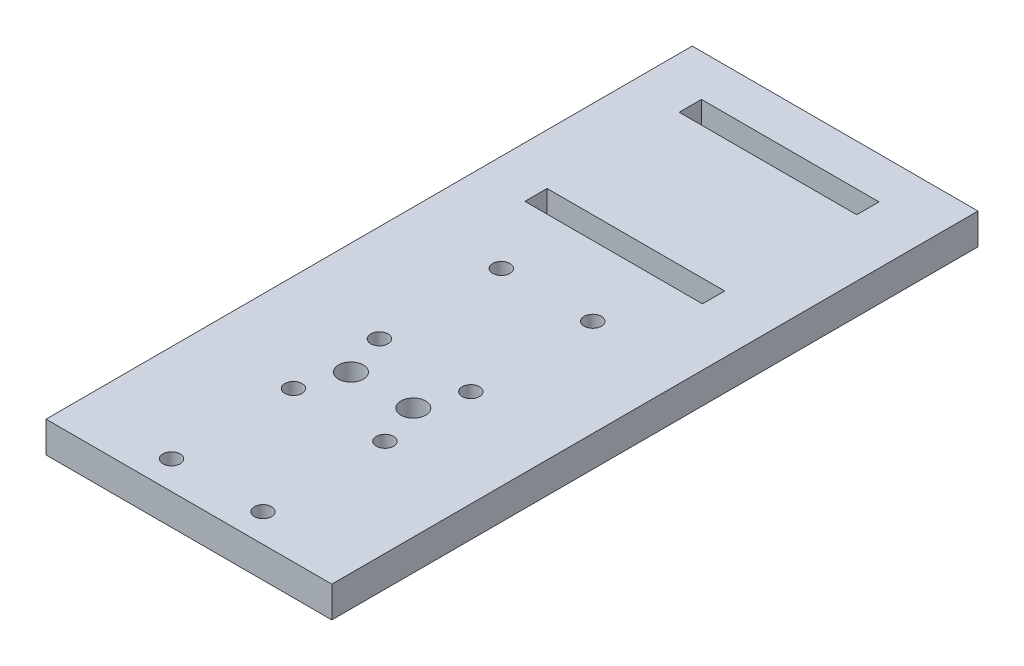
ISO-10303-21;
HEADER;
FILE_DESCRIPTION(('STEP AP214'),'2;1');
FILE_NAME('part.step','',(''),(''),'','','');
FILE_SCHEMA(('AUTOMOTIVE_DESIGN { 1 0 10303 214 1 1 1 1 }'));
ENDSEC;
DATA;
#1=APPLICATION_CONTEXT('core data for automotive mechanical design processes');
#2=APPLICATION_PROTOCOL_DEFINITION('international standard','automotive_design',2000,#1);
#3=PRODUCT_CONTEXT('',#1,'mechanical');
#4=PRODUCT('Part','Part','',(#3));
#5=PRODUCT_RELATED_PRODUCT_CATEGORY('part','',(#4));
#6=PRODUCT_DEFINITION_FORMATION('','',#4);
#7=PRODUCT_DEFINITION_CONTEXT('part definition',#1,'design');
#8=PRODUCT_DEFINITION('design','',#6,#7);
#9=PRODUCT_DEFINITION_SHAPE('','',#8);
#10=(LENGTH_UNIT() NAMED_UNIT(*) SI_UNIT(.MILLI.,.METRE.));
#11=(NAMED_UNIT(*) PLANE_ANGLE_UNIT() SI_UNIT($,.RADIAN.));
#12=(NAMED_UNIT(*) SI_UNIT($,.STERADIAN.) SOLID_ANGLE_UNIT());
#13=UNCERTAINTY_MEASURE_WITH_UNIT(LENGTH_MEASURE(1.E-05),#10,'distance_accuracy_value','');
#14=(GEOMETRIC_REPRESENTATION_CONTEXT(3) GLOBAL_UNCERTAINTY_ASSIGNED_CONTEXT((#13)) GLOBAL_UNIT_ASSIGNED_CONTEXT((#10,
#11,#12)) REPRESENTATION_CONTEXT('',''));
#15=CARTESIAN_POINT('',(0.,0.,0.));
#16=DIRECTION('',(0.,0.,1.));
#17=DIRECTION('',(1.,0.,0.));
#18=AXIS2_PLACEMENT_3D('',#15,#16,#17);
#19=CARTESIAN_POINT('',(0.,5.969,0.));
#20=DIRECTION('',(0.,-1.,0.));
#21=DIRECTION('',(0.,0.,-1.));
#22=AXIS2_PLACEMENT_3D('',#19,#20,#21);
#23=PLANE('',#22);
#24=DIRECTION('',(0.,0.,1.));
#25=VECTOR('',#24,1.);
#26=CARTESIAN_POINT('',(0.,5.969,0.));
#27=LINE('',#26,#25);
#28=CARTESIAN_POINT('',(0.,5.969,-124.36));
#29=VERTEX_POINT('',#28);
#30=CARTESIAN_POINT('',(0.,5.969,0.));
#31=VERTEX_POINT('',#30);
#32=EDGE_CURVE('E269',#29,#31,#27,.T.);
#33=ORIENTED_EDGE('',*,*,#32,.T.);
#34=DIRECTION('',(1.,0.,0.));
#35=VECTOR('',#34,1.);
#36=CARTESIAN_POINT('',(0.,5.969,0.));
#37=LINE('',#36,#35);
#38=CARTESIAN_POINT('',(55.,5.969,0.));
#39=VERTEX_POINT('',#38);
#40=EDGE_CURVE('E49',#31,#39,#37,.T.);
#41=ORIENTED_EDGE('',*,*,#40,.T.);
#42=DIRECTION('',(0.,0.,-1.));
#43=VECTOR('',#42,1.);
#44=CARTESIAN_POINT('',(55.,5.969,0.));
#45=LINE('',#44,#43);
#46=CARTESIAN_POINT('',(55.,5.969,-124.36));
#47=VERTEX_POINT('',#46);
#48=EDGE_CURVE('E273',#39,#47,#45,.T.);
#49=ORIENTED_EDGE('',*,*,#48,.T.);
#50=DIRECTION('',(-1.,0.,0.));
#51=VECTOR('',#50,1.);
#52=CARTESIAN_POINT('',(55.,5.969,-124.36));
#53=LINE('',#52,#51);
#54=EDGE_CURVE('E190',#47,#29,#53,.T.);
#55=ORIENTED_EDGE('',*,*,#54,.T.);
#56=EDGE_LOOP('',(#33,#41,#49,#55));
#57=FACE_BOUND('',#56,.T.);
#58=CARTESIAN_POINT('',(18.7,5.969,-68.92));
#59=DIRECTION('',(0.,1.,0.));
#60=DIRECTION('',(0.,0.,1.));
#61=AXIS2_PLACEMENT_3D('',#58,#59,#60);
#62=CIRCLE('',#61,1.66);
#63=CARTESIAN_POINT('',(18.7,5.969,-67.26));
#64=VERTEX_POINT('',#63);
#65=EDGE_CURVE('E263',#64,#64,#62,.T.);
#66=ORIENTED_EDGE('',*,*,#65,.F.);
#67=EDGE_LOOP('',(#66));
#68=FACE_BOUND('',#67,.T.);
#69=CARTESIAN_POINT('',(36.3,5.969,-68.92));
#70=DIRECTION('',(0.,1.,0.));
#71=DIRECTION('',(0.,0.,1.));
#72=AXIS2_PLACEMENT_3D('',#69,#70,#71);
#73=CIRCLE('',#72,1.66);
#74=CARTESIAN_POINT('',(36.3,5.969,-67.26));
#75=VERTEX_POINT('',#74);
#76=EDGE_CURVE('E257',#75,#75,#73,.T.);
#77=ORIENTED_EDGE('',*,*,#76,.F.);
#78=EDGE_LOOP('',(#77));
#79=FACE_BOUND('',#78,.T.);
#80=CARTESIAN_POINT('',(36.3,5.969,-45.46));
#81=DIRECTION('',(0.,1.,0.));
#82=DIRECTION('',(0.,0.,1.));
#83=AXIS2_PLACEMENT_3D('',#80,#81,#82);
#84=CIRCLE('',#83,1.66);
#85=CARTESIAN_POINT('',(36.3,5.969,-43.8));
#86=VERTEX_POINT('',#85);
#87=EDGE_CURVE('E251',#86,#86,#84,.T.);
#88=ORIENTED_EDGE('',*,*,#87,.F.);
#89=EDGE_LOOP('',(#88));
#90=FACE_BOUND('',#89,.T.);
#91=CARTESIAN_POINT('',(18.7,5.969,-45.46));
#92=DIRECTION('',(0.,1.,0.));
#93=DIRECTION('',(0.,0.,1.));
#94=AXIS2_PLACEMENT_3D('',#91,#92,#93);
#95=CIRCLE('',#94,1.66);
#96=CARTESIAN_POINT('',(18.7,5.969,-43.8));
#97=VERTEX_POINT('',#96);
#98=EDGE_CURVE('E245',#97,#97,#95,.T.);
#99=ORIENTED_EDGE('',*,*,#98,.F.);
#100=EDGE_LOOP('',(#99));
#101=FACE_BOUND('',#100,.T.);
#102=CARTESIAN_POINT('',(18.7,5.969,-28.92));
#103=DIRECTION('',(0.,1.,0.));
#104=DIRECTION('',(0.,0.,-1.));
#105=AXIS2_PLACEMENT_3D('',#102,#103,#104);
#106=CIRCLE('',#105,1.66);
#107=CARTESIAN_POINT('',(18.7,5.969,-30.58));
#108=VERTEX_POINT('',#107);
#109=EDGE_CURVE('E239',#108,#108,#106,.T.);
#110=ORIENTED_EDGE('',*,*,#109,.F.);
#111=EDGE_LOOP('',(#110));
#112=FACE_BOUND('',#111,.T.);
#113=CARTESIAN_POINT('',(36.3,5.969,-28.92));
#114=DIRECTION('',(0.,1.,0.));
#115=DIRECTION('',(0.,0.,-1.));
#116=AXIS2_PLACEMENT_3D('',#113,#114,#115);
#117=CIRCLE('',#116,1.66);
#118=CARTESIAN_POINT('',(36.3,5.969,-30.58));
#119=VERTEX_POINT('',#118);
#120=EDGE_CURVE('E233',#119,#119,#117,.T.);
#121=ORIENTED_EDGE('',*,*,#120,.F.);
#122=EDGE_LOOP('',(#121));
#123=FACE_BOUND('',#122,.T.);
#124=CARTESIAN_POINT('',(36.3,5.969,-5.45999999999999));
#125=DIRECTION('',(0.,1.,0.));
#126=DIRECTION('',(0.,0.,-1.));
#127=AXIS2_PLACEMENT_3D('',#124,#125,#126);
#128=CIRCLE('',#127,1.66);
#129=CARTESIAN_POINT('',(36.3,5.969,-7.11999999999999));
#130=VERTEX_POINT('',#129);
#131=EDGE_CURVE('E227',#130,#130,#128,.T.);
#132=ORIENTED_EDGE('',*,*,#131,.F.);
#133=EDGE_LOOP('',(#132));
#134=FACE_BOUND('',#133,.T.);
#135=CARTESIAN_POINT('',(18.7,5.969,-5.45999999999999));
#136=DIRECTION('',(0.,1.,0.));
#137=DIRECTION('',(0.,0.,-1.));
#138=AXIS2_PLACEMENT_3D('',#135,#136,#137);
#139=CIRCLE('',#138,1.66);
#140=CARTESIAN_POINT('',(18.7,5.969,-7.12));
#141=VERTEX_POINT('',#140);
#142=EDGE_CURVE('E221',#141,#141,#139,.T.);
#143=ORIENTED_EDGE('',*,*,#142,.F.);
#144=EDGE_LOOP('',(#143));
#145=FACE_BOUND('',#144,.T.);
#146=CARTESIAN_POINT('',(33.5,5.969,-37.19));
#147=DIRECTION('',(0.,1.,0.));
#148=DIRECTION('',(0.,0.,-1.));
#149=AXIS2_PLACEMENT_3D('',#146,#147,#148);
#150=CIRCLE('',#149,2.38125);
#151=CARTESIAN_POINT('',(33.5,5.969,-39.57125));
#152=VERTEX_POINT('',#151);
#153=EDGE_CURVE('E215',#152,#152,#150,.T.);
#154=ORIENTED_EDGE('',*,*,#153,.F.);
#155=EDGE_LOOP('',(#154));
#156=FACE_BOUND('',#155,.T.);
#157=CARTESIAN_POINT('',(21.5,5.969,-37.19));
#158=DIRECTION('',(0.,1.,0.));
#159=DIRECTION('',(0.,0.,1.));
#160=AXIS2_PLACEMENT_3D('',#157,#158,#159);
#161=CIRCLE('',#160,2.38125);
#162=CARTESIAN_POINT('',(21.5,5.969,-34.80875));
#163=VERTEX_POINT('',#162);
#164=EDGE_CURVE('E209',#163,#163,#161,.T.);
#165=ORIENTED_EDGE('',*,*,#164,.F.);
#166=EDGE_LOOP('',(#165));
#167=FACE_BOUND('',#166,.T.);
#168=DIRECTION('',(0.,0.,-1.));
#169=VECTOR('',#168,1.);
#170=CARTESIAN_POINT('',(43.95,5.969,-116.36));
#171=LINE('',#170,#169);
#172=CARTESIAN_POINT('',(43.95,5.969,-112.08));
#173=VERTEX_POINT('',#172);
#174=CARTESIAN_POINT('',(43.95,5.969,-116.36));
#175=VERTEX_POINT('',#174);
#176=EDGE_CURVE('E131',#173,#175,#171,.T.);
#177=ORIENTED_EDGE('',*,*,#176,.F.);
#178=DIRECTION('',(1.,0.,0.));
#179=VECTOR('',#178,1.);
#180=CARTESIAN_POINT('',(43.95,5.969,-112.08));
#181=LINE('',#180,#179);
#182=CARTESIAN_POINT('',(9.77999999999999,5.969,-112.08));
#183=VERTEX_POINT('',#182);
#184=EDGE_CURVE('E146',#183,#173,#181,.T.);
#185=ORIENTED_EDGE('',*,*,#184,.F.);
#186=DIRECTION('',(0.,0.,1.));
#187=VECTOR('',#186,1.);
#188=CARTESIAN_POINT('',(9.77999999999999,5.969,-116.36));
#189=LINE('',#188,#187);
#190=CARTESIAN_POINT('',(9.77999999999999,5.969,-116.36));
#191=VERTEX_POINT('',#190);
#192=EDGE_CURVE('E149',#191,#183,#189,.T.);
#193=ORIENTED_EDGE('',*,*,#192,.F.);
#194=DIRECTION('',(-1.,0.,0.));
#195=VECTOR('',#194,1.);
#196=CARTESIAN_POINT('',(43.95,5.969,-116.36));
#197=LINE('',#196,#195);
#198=EDGE_CURVE('E155',#175,#191,#197,.T.);
#199=ORIENTED_EDGE('',*,*,#198,.F.);
#200=EDGE_LOOP('',(#177,#185,#193,#199));
#201=FACE_BOUND('',#200,.T.);
#202=DIRECTION('',(0.,0.,-1.));
#203=VECTOR('',#202,1.);
#204=CARTESIAN_POINT('',(43.95,5.969,-82.38));
#205=LINE('',#204,#203);
#206=CARTESIAN_POINT('',(43.95,5.969,-82.38));
#207=VERTEX_POINT('',#206);
#208=CARTESIAN_POINT('',(43.95,5.969,-86.66));
#209=VERTEX_POINT('',#208);
#210=EDGE_CURVE('E161',#207,#209,#205,.T.);
#211=ORIENTED_EDGE('',*,*,#210,.F.);
#212=DIRECTION('',(1.,0.,0.));
#213=VECTOR('',#212,1.);
#214=CARTESIAN_POINT('',(43.95,5.969,-82.38));
#215=LINE('',#214,#213);
#216=CARTESIAN_POINT('',(9.78,5.969,-82.38));
#217=VERTEX_POINT('',#216);
#218=EDGE_CURVE('E169',#217,#207,#215,.T.);
#219=ORIENTED_EDGE('',*,*,#218,.F.);
#220=DIRECTION('',(0.,0.,1.));
#221=VECTOR('',#220,1.);
#222=CARTESIAN_POINT('',(9.78,5.969,-82.38));
#223=LINE('',#222,#221);
#224=CARTESIAN_POINT('',(9.78,5.969,-86.66));
#225=VERTEX_POINT('',#224);
#226=EDGE_CURVE('E183',#225,#217,#223,.T.);
#227=ORIENTED_EDGE('',*,*,#226,.F.);
#228=DIRECTION('',(-1.,0.,0.));
#229=VECTOR('',#228,1.);
#230=CARTESIAN_POINT('',(43.95,5.969,-86.66));
#231=LINE('',#230,#229);
#232=EDGE_CURVE('E180',#209,#225,#231,.T.);
#233=ORIENTED_EDGE('',*,*,#232,.F.);
#234=EDGE_LOOP('',(#211,#219,#227,#233));
#235=FACE_BOUND('',#234,.T.);
#236=ADVANCED_FACE('F32',(#57,#68,#79,#90,#101,#112,#123,#134,#145,#156,#167,#201,#235),#23,.F.);
#237=CARTESIAN_POINT('',(0.,0.,0.));
#238=DIRECTION('',(0.,-1.,0.));
#239=DIRECTION('',(0.,0.,-1.));
#240=AXIS2_PLACEMENT_3D('',#237,#238,#239);
#241=PLANE('',#240);
#242=CARTESIAN_POINT('',(33.5,0.,-37.19));
#243=DIRECTION('',(0.,1.,0.));
#244=DIRECTION('',(0.,0.,-1.));
#245=AXIS2_PLACEMENT_3D('',#242,#243,#244);
#246=CIRCLE('',#245,2.38125);
#247=CARTESIAN_POINT('',(33.5,0.,-39.57125));
#248=VERTEX_POINT('',#247);
#249=EDGE_CURVE('E212',#248,#248,#246,.T.);
#250=ORIENTED_EDGE('',*,*,#249,.T.);
#251=EDGE_LOOP('',(#250));
#252=FACE_BOUND('',#251,.T.);
#253=CARTESIAN_POINT('',(36.3,0.,-5.45999999999999));
#254=DIRECTION('',(0.,1.,0.));
#255=DIRECTION('',(0.,0.,-1.));
#256=AXIS2_PLACEMENT_3D('',#253,#254,#255);
#257=CIRCLE('',#256,1.66);
#258=CARTESIAN_POINT('',(36.3,0.,-7.11999999999999));
#259=VERTEX_POINT('',#258);
#260=EDGE_CURVE('E224',#259,#259,#257,.T.);
#261=ORIENTED_EDGE('',*,*,#260,.T.);
#262=EDGE_LOOP('',(#261));
#263=FACE_BOUND('',#262,.T.);
#264=CARTESIAN_POINT('',(18.7,0.,-28.92));
#265=DIRECTION('',(0.,1.,0.));
#266=DIRECTION('',(0.,0.,-1.));
#267=AXIS2_PLACEMENT_3D('',#264,#265,#266);
#268=CIRCLE('',#267,1.66);
#269=CARTESIAN_POINT('',(18.7,0.,-30.58));
#270=VERTEX_POINT('',#269);
#271=EDGE_CURVE('E236',#270,#270,#268,.T.);
#272=ORIENTED_EDGE('',*,*,#271,.T.);
#273=EDGE_LOOP('',(#272));
#274=FACE_BOUND('',#273,.T.);
#275=CARTESIAN_POINT('',(36.3,0.,-45.46));
#276=DIRECTION('',(0.,1.,0.));
#277=DIRECTION('',(0.,0.,1.));
#278=AXIS2_PLACEMENT_3D('',#275,#276,#277);
#279=CIRCLE('',#278,1.66);
#280=CARTESIAN_POINT('',(36.3,0.,-43.8));
#281=VERTEX_POINT('',#280);
#282=EDGE_CURVE('E248',#281,#281,#279,.T.);
#283=ORIENTED_EDGE('',*,*,#282,.T.);
#284=EDGE_LOOP('',(#283));
#285=FACE_BOUND('',#284,.T.);
#286=CARTESIAN_POINT('',(18.7,0.,-68.92));
#287=DIRECTION('',(0.,1.,0.));
#288=DIRECTION('',(0.,0.,1.));
#289=AXIS2_PLACEMENT_3D('',#286,#287,#288);
#290=CIRCLE('',#289,1.66);
#291=CARTESIAN_POINT('',(18.7,0.,-67.26));
#292=VERTEX_POINT('',#291);
#293=EDGE_CURVE('E260',#292,#292,#290,.T.);
#294=ORIENTED_EDGE('',*,*,#293,.T.);
#295=EDGE_LOOP('',(#294));
#296=FACE_BOUND('',#295,.T.);
#297=DIRECTION('',(0.,0.,1.));
#298=VECTOR('',#297,1.);
#299=CARTESIAN_POINT('',(0.,0.,0.));
#300=LINE('',#299,#298);
#301=CARTESIAN_POINT('',(0.,0.,-124.36));
#302=VERTEX_POINT('',#301);
#303=CARTESIAN_POINT('',(0.,0.,0.));
#304=VERTEX_POINT('',#303);
#305=EDGE_CURVE('E266',#302,#304,#300,.T.);
#306=ORIENTED_EDGE('',*,*,#305,.F.);
#307=DIRECTION('',(-1.,0.,0.));
#308=VECTOR('',#307,1.);
#309=CARTESIAN_POINT('',(55.,0.,-124.36));
#310=LINE('',#309,#308);
#311=CARTESIAN_POINT('',(55.,0.,-124.36));
#312=VERTEX_POINT('',#311);
#313=EDGE_CURVE('E197',#312,#302,#310,.T.);
#314=ORIENTED_EDGE('',*,*,#313,.F.);
#315=DIRECTION('',(0.,0.,-1.));
#316=VECTOR('',#315,1.);
#317=CARTESIAN_POINT('',(55.,0.,0.));
#318=LINE('',#317,#316);
#319=CARTESIAN_POINT('',(55.,0.,0.));
#320=VERTEX_POINT('',#319);
#321=EDGE_CURVE('E271',#320,#312,#318,.T.);
#322=ORIENTED_EDGE('',*,*,#321,.F.);
#323=DIRECTION('',(1.,0.,0.));
#324=VECTOR('',#323,1.);
#325=CARTESIAN_POINT('',(0.,0.,0.));
#326=LINE('',#325,#324);
#327=EDGE_CURVE('E60',#304,#320,#326,.T.);
#328=ORIENTED_EDGE('',*,*,#327,.F.);
#329=EDGE_LOOP('',(#306,#314,#322,#328));
#330=FACE_BOUND('',#329,.T.);
#331=CARTESIAN_POINT('',(36.3,0.,-68.92));
#332=DIRECTION('',(0.,1.,0.));
#333=DIRECTION('',(0.,0.,1.));
#334=AXIS2_PLACEMENT_3D('',#331,#332,#333);
#335=CIRCLE('',#334,1.66);
#336=CARTESIAN_POINT('',(36.3,0.,-67.26));
#337=VERTEX_POINT('',#336);
#338=EDGE_CURVE('E254',#337,#337,#335,.T.);
#339=ORIENTED_EDGE('',*,*,#338,.T.);
#340=EDGE_LOOP('',(#339));
#341=FACE_BOUND('',#340,.T.);
#342=CARTESIAN_POINT('',(18.7,0.,-45.46));
#343=DIRECTION('',(0.,1.,0.));
#344=DIRECTION('',(0.,0.,1.));
#345=AXIS2_PLACEMENT_3D('',#342,#343,#344);
#346=CIRCLE('',#345,1.66);
#347=CARTESIAN_POINT('',(18.7,0.,-43.8));
#348=VERTEX_POINT('',#347);
#349=EDGE_CURVE('E242',#348,#348,#346,.T.);
#350=ORIENTED_EDGE('',*,*,#349,.T.);
#351=EDGE_LOOP('',(#350));
#352=FACE_BOUND('',#351,.T.);
#353=CARTESIAN_POINT('',(36.3,0.,-28.92));
#354=DIRECTION('',(0.,1.,0.));
#355=DIRECTION('',(0.,0.,-1.));
#356=AXIS2_PLACEMENT_3D('',#353,#354,#355);
#357=CIRCLE('',#356,1.66);
#358=CARTESIAN_POINT('',(36.3,0.,-30.58));
#359=VERTEX_POINT('',#358);
#360=EDGE_CURVE('E230',#359,#359,#357,.T.);
#361=ORIENTED_EDGE('',*,*,#360,.T.);
#362=EDGE_LOOP('',(#361));
#363=FACE_BOUND('',#362,.T.);
#364=CARTESIAN_POINT('',(18.7,0.,-5.45999999999999));
#365=DIRECTION('',(0.,1.,0.));
#366=DIRECTION('',(0.,0.,-1.));
#367=AXIS2_PLACEMENT_3D('',#364,#365,#366);
#368=CIRCLE('',#367,1.66);
#369=CARTESIAN_POINT('',(18.7,0.,-7.12));
#370=VERTEX_POINT('',#369);
#371=EDGE_CURVE('E218',#370,#370,#368,.T.);
#372=ORIENTED_EDGE('',*,*,#371,.T.);
#373=EDGE_LOOP('',(#372));
#374=FACE_BOUND('',#373,.T.);
#375=CARTESIAN_POINT('',(21.5,0.,-37.19));
#376=DIRECTION('',(0.,1.,0.));
#377=DIRECTION('',(0.,0.,1.));
#378=AXIS2_PLACEMENT_3D('',#375,#376,#377);
#379=CIRCLE('',#378,2.38125);
#380=CARTESIAN_POINT('',(21.5,0.,-34.80875));
#381=VERTEX_POINT('',#380);
#382=EDGE_CURVE('E206',#381,#381,#379,.T.);
#383=ORIENTED_EDGE('',*,*,#382,.T.);
#384=EDGE_LOOP('',(#383));
#385=FACE_BOUND('',#384,.T.);
#386=DIRECTION('',(1.,0.,0.));
#387=VECTOR('',#386,1.);
#388=CARTESIAN_POINT('',(43.95,0.,-112.08));
#389=LINE('',#388,#387);
#390=CARTESIAN_POINT('',(9.77999999999999,0.,-112.08));
#391=VERTEX_POINT('',#390);
#392=CARTESIAN_POINT('',(43.95,0.,-112.08));
#393=VERTEX_POINT('',#392);
#394=EDGE_CURVE('E136',#391,#393,#389,.T.);
#395=ORIENTED_EDGE('',*,*,#394,.T.);
#396=DIRECTION('',(0.,0.,-1.));
#397=VECTOR('',#396,1.);
#398=CARTESIAN_POINT('',(43.95,0.,-116.36));
#399=LINE('',#398,#397);
#400=CARTESIAN_POINT('',(43.95,0.,-116.36));
#401=VERTEX_POINT('',#400);
#402=EDGE_CURVE('E128',#393,#401,#399,.T.);
#403=ORIENTED_EDGE('',*,*,#402,.T.);
#404=DIRECTION('',(-1.,0.,0.));
#405=VECTOR('',#404,1.);
#406=CARTESIAN_POINT('',(43.95,0.,-116.36));
#407=LINE('',#406,#405);
#408=CARTESIAN_POINT('',(9.77999999999999,0.,-116.36));
#409=VERTEX_POINT('',#408);
#410=EDGE_CURVE('E139',#401,#409,#407,.T.);
#411=ORIENTED_EDGE('',*,*,#410,.T.);
#412=DIRECTION('',(0.,0.,1.));
#413=VECTOR('',#412,1.);
#414=CARTESIAN_POINT('',(9.77999999999999,0.,-116.36));
#415=LINE('',#414,#413);
#416=EDGE_CURVE('E67',#409,#391,#415,.T.);
#417=ORIENTED_EDGE('',*,*,#416,.T.);
#418=EDGE_LOOP('',(#395,#403,#411,#417));
#419=FACE_BOUND('',#418,.T.);
#420=DIRECTION('',(1.,0.,0.));
#421=VECTOR('',#420,1.);
#422=CARTESIAN_POINT('',(43.95,0.,-82.38));
#423=LINE('',#422,#421);
#424=CARTESIAN_POINT('',(9.78,0.,-82.38));
#425=VERTEX_POINT('',#424);
#426=CARTESIAN_POINT('',(43.95,0.,-82.38));
#427=VERTEX_POINT('',#426);
#428=EDGE_CURVE('E175',#425,#427,#423,.T.);
#429=ORIENTED_EDGE('',*,*,#428,.T.);
#430=DIRECTION('',(0.,0.,-1.));
#431=VECTOR('',#430,1.);
#432=CARTESIAN_POINT('',(43.95,0.,-82.38));
#433=LINE('',#432,#431);
#434=CARTESIAN_POINT('',(43.95,0.,-86.66));
#435=VERTEX_POINT('',#434);
#436=EDGE_CURVE('E165',#427,#435,#433,.T.);
#437=ORIENTED_EDGE('',*,*,#436,.T.);
#438=DIRECTION('',(-1.,0.,0.));
#439=VECTOR('',#438,1.);
#440=CARTESIAN_POINT('',(43.95,0.,-86.66));
#441=LINE('',#440,#439);
#442=CARTESIAN_POINT('',(9.78,0.,-86.66));
#443=VERTEX_POINT('',#442);
#444=EDGE_CURVE('E168',#435,#443,#441,.T.);
#445=ORIENTED_EDGE('',*,*,#444,.T.);
#446=DIRECTION('',(0.,0.,1.));
#447=VECTOR('',#446,1.);
#448=CARTESIAN_POINT('',(9.78,0.,-82.38));
#449=LINE('',#448,#447);
#450=EDGE_CURVE('E172',#443,#425,#449,.T.);
#451=ORIENTED_EDGE('',*,*,#450,.T.);
#452=EDGE_LOOP('',(#429,#437,#445,#451));
#453=FACE_BOUND('',#452,.T.);
#454=ADVANCED_FACE('F143',(#252,#263,#274,#285,#296,#330,#341,#352,#363,#374,#385,#419,#453),
#241,.T.);
#455=CARTESIAN_POINT('',(0.,5.969,0.));
#456=DIRECTION('',(1.,0.,0.));
#457=DIRECTION('',(0.,0.,-1.));
#458=AXIS2_PLACEMENT_3D('',#455,#456,#457);
#459=PLANE('',#458);
#460=ORIENTED_EDGE('',*,*,#305,.T.);
#461=DIRECTION('',(0.,-1.,0.));
#462=VECTOR('',#461,1.);
#463=CARTESIAN_POINT('',(0.,5.969,0.));
#464=LINE('',#463,#462);
#465=EDGE_CURVE('E11',#31,#304,#464,.T.);
#466=ORIENTED_EDGE('',*,*,#465,.F.);
#467=ORIENTED_EDGE('',*,*,#32,.F.);
#468=DIRECTION('',(0.,1.,0.));
#469=VECTOR('',#468,1.);
#470=CARTESIAN_POINT('',(0.,0.,-124.36));
#471=LINE('',#470,#469);
#472=EDGE_CURVE('E203',#302,#29,#471,.T.);
#473=ORIENTED_EDGE('',*,*,#472,.F.);
#474=EDGE_LOOP('',(#460,#466,#467,#473));
#475=FACE_BOUND('',#474,.T.);
#476=ADVANCED_FACE('F34',(#475),#459,.F.);
#477=CARTESIAN_POINT('',(0.,5.969,0.));
#478=DIRECTION('',(0.,0.,-1.));
#479=DIRECTION('',(-1.,0.,0.));
#480=AXIS2_PLACEMENT_3D('',#477,#478,#479);
#481=PLANE('',#480);
#482=ORIENTED_EDGE('',*,*,#327,.T.);
#483=DIRECTION('',(0.,-1.,0.));
#484=VECTOR('',#483,1.);
#485=CARTESIAN_POINT('',(55.,5.969,0.));
#486=LINE('',#485,#484);
#487=EDGE_CURVE('E41',#39,#320,#486,.T.);
#488=ORIENTED_EDGE('',*,*,#487,.F.);
#489=ORIENTED_EDGE('',*,*,#40,.F.);
#490=ORIENTED_EDGE('',*,*,#465,.T.);
#491=EDGE_LOOP('',(#482,#488,#489,#490));
#492=FACE_BOUND('',#491,.T.);
#493=ADVANCED_FACE('F293',(#492),#481,.F.);
#494=CARTESIAN_POINT('',(55.,5.969,0.));
#495=DIRECTION('',(-1.,0.,0.));
#496=DIRECTION('',(0.,0.,1.));
#497=AXIS2_PLACEMENT_3D('',#494,#495,#496);
#498=PLANE('',#497);
#499=ORIENTED_EDGE('',*,*,#321,.T.);
#500=DIRECTION('',(0.,1.,0.));
#501=VECTOR('',#500,1.);
#502=CARTESIAN_POINT('',(55.,0.,-124.36));
#503=LINE('',#502,#501);
#504=EDGE_CURVE('E200',#312,#47,#503,.T.);
#505=ORIENTED_EDGE('',*,*,#504,.T.);
#506=ORIENTED_EDGE('',*,*,#48,.F.);
#507=ORIENTED_EDGE('',*,*,#487,.T.);
#508=EDGE_LOOP('',(#499,#505,#506,#507));
#509=FACE_BOUND('',#508,.T.);
#510=ADVANCED_FACE('F281',(#509),#498,.F.);
#511=CARTESIAN_POINT('',(18.7,5.969,-68.92));
#512=DIRECTION('',(0.,-1.,0.));
#513=DIRECTION('',(0.,0.,-1.));
#514=AXIS2_PLACEMENT_3D('',#511,#512,#513);
#515=CYLINDRICAL_SURFACE('',#514,1.66);
#516=ORIENTED_EDGE('',*,*,#65,.T.);
#517=EDGE_LOOP('',(#516));
#518=FACE_BOUND('',#517,.T.);
#519=ORIENTED_EDGE('',*,*,#293,.F.);
#520=EDGE_LOOP('',(#519));
#521=FACE_BOUND('',#520,.T.);
#522=ADVANCED_FACE('F299',(#518,#521),#515,.F.);
#523=CARTESIAN_POINT('',(36.3,5.969,-68.92));
#524=DIRECTION('',(0.,-1.,0.));
#525=DIRECTION('',(0.,0.,-1.));
#526=AXIS2_PLACEMENT_3D('',#523,#524,#525);
#527=CYLINDRICAL_SURFACE('',#526,1.66);
#528=ORIENTED_EDGE('',*,*,#76,.T.);
#529=EDGE_LOOP('',(#528));
#530=FACE_BOUND('',#529,.T.);
#531=ORIENTED_EDGE('',*,*,#338,.F.);
#532=EDGE_LOOP('',(#531));
#533=FACE_BOUND('',#532,.T.);
#534=ADVANCED_FACE('F311',(#530,#533),#527,.F.);
#535=CARTESIAN_POINT('',(36.3,5.969,-45.46));
#536=DIRECTION('',(0.,-1.,0.));
#537=DIRECTION('',(0.,0.,-1.));
#538=AXIS2_PLACEMENT_3D('',#535,#536,#537);
#539=CYLINDRICAL_SURFACE('',#538,1.66);
#540=ORIENTED_EDGE('',*,*,#87,.T.);
#541=EDGE_LOOP('',(#540));
#542=FACE_BOUND('',#541,.T.);
#543=ORIENTED_EDGE('',*,*,#282,.F.);
#544=EDGE_LOOP('',(#543));
#545=FACE_BOUND('',#544,.T.);
#546=ADVANCED_FACE('F315',(#542,#545),#539,.F.);
#547=CARTESIAN_POINT('',(18.7,5.969,-45.46));
#548=DIRECTION('',(0.,-1.,0.));
#549=DIRECTION('',(0.,0.,-1.));
#550=AXIS2_PLACEMENT_3D('',#547,#548,#549);
#551=CYLINDRICAL_SURFACE('',#550,1.66);
#552=ORIENTED_EDGE('',*,*,#98,.T.);
#553=EDGE_LOOP('',(#552));
#554=FACE_BOUND('',#553,.T.);
#555=ORIENTED_EDGE('',*,*,#349,.F.);
#556=EDGE_LOOP('',(#555));
#557=FACE_BOUND('',#556,.T.);
#558=ADVANCED_FACE('F319',(#554,#557),#551,.F.);
#559=CARTESIAN_POINT('',(18.7,5.969,-28.92));
#560=DIRECTION('',(0.,-1.,0.));
#561=DIRECTION('',(0.,0.,-1.));
#562=AXIS2_PLACEMENT_3D('',#559,#560,#561);
#563=CYLINDRICAL_SURFACE('',#562,1.66);
#564=ORIENTED_EDGE('',*,*,#109,.T.);
#565=EDGE_LOOP('',(#564));
#566=FACE_BOUND('',#565,.T.);
#567=ORIENTED_EDGE('',*,*,#271,.F.);
#568=EDGE_LOOP('',(#567));
#569=FACE_BOUND('',#568,.T.);
#570=ADVANCED_FACE('F323',(#566,#569),#563,.F.);
#571=CARTESIAN_POINT('',(36.3,5.969,-28.92));
#572=DIRECTION('',(0.,-1.,0.));
#573=DIRECTION('',(0.,0.,-1.));
#574=AXIS2_PLACEMENT_3D('',#571,#572,#573);
#575=CYLINDRICAL_SURFACE('',#574,1.66);
#576=ORIENTED_EDGE('',*,*,#120,.T.);
#577=EDGE_LOOP('',(#576));
#578=FACE_BOUND('',#577,.T.);
#579=ORIENTED_EDGE('',*,*,#360,.F.);
#580=EDGE_LOOP('',(#579));
#581=FACE_BOUND('',#580,.T.);
#582=ADVANCED_FACE('F327',(#578,#581),#575,.F.);
#583=CARTESIAN_POINT('',(36.3,5.969,-5.45999999999999));
#584=DIRECTION('',(0.,-1.,0.));
#585=DIRECTION('',(0.,0.,-1.));
#586=AXIS2_PLACEMENT_3D('',#583,#584,#585);
#587=CYLINDRICAL_SURFACE('',#586,1.66);
#588=ORIENTED_EDGE('',*,*,#131,.T.);
#589=EDGE_LOOP('',(#588));
#590=FACE_BOUND('',#589,.T.);
#591=ORIENTED_EDGE('',*,*,#260,.F.);
#592=EDGE_LOOP('',(#591));
#593=FACE_BOUND('',#592,.T.);
#594=ADVANCED_FACE('F331',(#590,#593),#587,.F.);
#595=CARTESIAN_POINT('',(18.7,5.969,-5.45999999999999));
#596=DIRECTION('',(0.,-1.,0.));
#597=DIRECTION('',(0.,0.,-1.));
#598=AXIS2_PLACEMENT_3D('',#595,#596,#597);
#599=CYLINDRICAL_SURFACE('',#598,1.66);
#600=ORIENTED_EDGE('',*,*,#142,.T.);
#601=EDGE_LOOP('',(#600));
#602=FACE_BOUND('',#601,.T.);
#603=ORIENTED_EDGE('',*,*,#371,.F.);
#604=EDGE_LOOP('',(#603));
#605=FACE_BOUND('',#604,.T.);
#606=ADVANCED_FACE('F335',(#602,#605),#599,.F.);
#607=CARTESIAN_POINT('',(33.5,5.969,-37.19));
#608=DIRECTION('',(0.,-1.,0.));
#609=DIRECTION('',(0.,0.,-1.));
#610=AXIS2_PLACEMENT_3D('',#607,#608,#609);
#611=CYLINDRICAL_SURFACE('',#610,2.38125);
#612=ORIENTED_EDGE('',*,*,#153,.T.);
#613=EDGE_LOOP('',(#612));
#614=FACE_BOUND('',#613,.T.);
#615=ORIENTED_EDGE('',*,*,#249,.F.);
#616=EDGE_LOOP('',(#615));
#617=FACE_BOUND('',#616,.T.);
#618=ADVANCED_FACE('F339',(#614,#617),#611,.F.);
#619=CARTESIAN_POINT('',(21.5,5.969,-37.19));
#620=DIRECTION('',(0.,-1.,0.));
#621=DIRECTION('',(0.,0.,-1.));
#622=AXIS2_PLACEMENT_3D('',#619,#620,#621);
#623=CYLINDRICAL_SURFACE('',#622,2.38125);
#624=ORIENTED_EDGE('',*,*,#164,.T.);
#625=EDGE_LOOP('',(#624));
#626=FACE_BOUND('',#625,.T.);
#627=ORIENTED_EDGE('',*,*,#382,.F.);
#628=EDGE_LOOP('',(#627));
#629=FACE_BOUND('',#628,.T.);
#630=ADVANCED_FACE('F343',(#626,#629),#623,.F.);
#631=CARTESIAN_POINT('',(55.,0.,-124.36));
#632=DIRECTION('',(0.,0.,-1.));
#633=DIRECTION('',(-1.,0.,0.));
#634=AXIS2_PLACEMENT_3D('',#631,#632,#633);
#635=PLANE('',#634);
#636=ORIENTED_EDGE('',*,*,#54,.F.);
#637=ORIENTED_EDGE('',*,*,#504,.F.);
#638=ORIENTED_EDGE('',*,*,#313,.T.);
#639=ORIENTED_EDGE('',*,*,#472,.T.);
#640=EDGE_LOOP('',(#636,#637,#638,#639));
#641=FACE_BOUND('',#640,.T.);
#642=ADVANCED_FACE('F289',(#641),#635,.T.);
#643=CARTESIAN_POINT('',(43.95,0.,-82.38));
#644=DIRECTION('',(1.,0.,0.));
#645=DIRECTION('',(0.,0.,-1.));
#646=AXIS2_PLACEMENT_3D('',#643,#644,#645);
#647=PLANE('',#646);
#648=ORIENTED_EDGE('',*,*,#210,.T.);
#649=DIRECTION('',(0.,1.,0.));
#650=VECTOR('',#649,1.);
#651=CARTESIAN_POINT('',(43.95,0.,-86.66));
#652=LINE('',#651,#650);
#653=EDGE_CURVE('E178',#435,#209,#652,.T.);
#654=ORIENTED_EDGE('',*,*,#653,.F.);
#655=ORIENTED_EDGE('',*,*,#436,.F.);
#656=DIRECTION('',(0.,1.,0.));
#657=VECTOR('',#656,1.);
#658=CARTESIAN_POINT('',(43.95,0.,-82.38));
#659=LINE('',#658,#657);
#660=EDGE_CURVE('E188',#427,#207,#659,.T.);
#661=ORIENTED_EDGE('',*,*,#660,.T.);
#662=EDGE_LOOP('',(#648,#654,#655,#661));
#663=FACE_BOUND('',#662,.T.);
#664=ADVANCED_FACE('F350',(#663),#647,.F.);
#665=CARTESIAN_POINT('',(43.95,0.,-82.38));
#666=DIRECTION('',(0.,0.,1.));
#667=DIRECTION('',(1.,0.,0.));
#668=AXIS2_PLACEMENT_3D('',#665,#666,#667);
#669=PLANE('',#668);
#670=ORIENTED_EDGE('',*,*,#218,.T.);
#671=ORIENTED_EDGE('',*,*,#660,.F.);
#672=ORIENTED_EDGE('',*,*,#428,.F.);
#673=DIRECTION('',(0.,1.,0.));
#674=VECTOR('',#673,1.);
#675=CARTESIAN_POINT('',(9.78,0.,-82.38));
#676=LINE('',#675,#674);
#677=EDGE_CURVE('E191',#425,#217,#676,.T.);
#678=ORIENTED_EDGE('',*,*,#677,.T.);
#679=EDGE_LOOP('',(#670,#671,#672,#678));
#680=FACE_BOUND('',#679,.T.);
#681=ADVANCED_FACE('F353',(#680),#669,.F.);
#682=CARTESIAN_POINT('',(9.78,0.,-82.38));
#683=DIRECTION('',(-1.,0.,0.));
#684=DIRECTION('',(0.,0.,1.));
#685=AXIS2_PLACEMENT_3D('',#682,#683,#684);
#686=PLANE('',#685);
#687=ORIENTED_EDGE('',*,*,#226,.T.);
#688=ORIENTED_EDGE('',*,*,#677,.F.);
#689=ORIENTED_EDGE('',*,*,#450,.F.);
#690=DIRECTION('',(0.,1.,0.));
#691=VECTOR('',#690,1.);
#692=CARTESIAN_POINT('',(9.78,0.,-86.66));
#693=LINE('',#692,#691);
#694=EDGE_CURVE('E193',#443,#225,#693,.T.);
#695=ORIENTED_EDGE('',*,*,#694,.T.);
#696=EDGE_LOOP('',(#687,#688,#689,#695));
#697=FACE_BOUND('',#696,.T.);
#698=ADVANCED_FACE('F358',(#697),#686,.F.);
#699=CARTESIAN_POINT('',(43.95,0.,-86.66));
#700=DIRECTION('',(0.,0.,-1.));
#701=DIRECTION('',(-1.,0.,0.));
#702=AXIS2_PLACEMENT_3D('',#699,#700,#701);
#703=PLANE('',#702);
#704=ORIENTED_EDGE('',*,*,#232,.T.);
#705=ORIENTED_EDGE('',*,*,#694,.F.);
#706=ORIENTED_EDGE('',*,*,#444,.F.);
#707=ORIENTED_EDGE('',*,*,#653,.T.);
#708=EDGE_LOOP('',(#704,#705,#706,#707));
#709=FACE_BOUND('',#708,.T.);
#710=ADVANCED_FACE('F355',(#709),#703,.F.);
#711=CARTESIAN_POINT('',(43.95,0.,-116.36));
#712=DIRECTION('',(1.,0.,0.));
#713=DIRECTION('',(0.,0.,-1.));
#714=AXIS2_PLACEMENT_3D('',#711,#712,#713);
#715=PLANE('',#714);
#716=ORIENTED_EDGE('',*,*,#176,.T.);
#717=DIRECTION('',(0.,1.,0.));
#718=VECTOR('',#717,1.);
#719=CARTESIAN_POINT('',(43.95,0.,-116.36));
#720=LINE('',#719,#718);
#721=EDGE_CURVE('E124',#401,#175,#720,.T.);
#722=ORIENTED_EDGE('',*,*,#721,.F.);
#723=ORIENTED_EDGE('',*,*,#402,.F.);
#724=DIRECTION('',(0.,1.,0.));
#725=VECTOR('',#724,1.);
#726=CARTESIAN_POINT('',(43.95,0.,-112.08));
#727=LINE('',#726,#725);
#728=EDGE_CURVE('E159',#393,#173,#727,.T.);
#729=ORIENTED_EDGE('',*,*,#728,.T.);
#730=EDGE_LOOP('',(#716,#722,#723,#729));
#731=FACE_BOUND('',#730,.T.);
#732=ADVANCED_FACE('F126',(#731),#715,.F.);
#733=CARTESIAN_POINT('',(43.95,0.,-112.08));
#734=DIRECTION('',(0.,0.,1.));
#735=DIRECTION('',(1.,0.,0.));
#736=AXIS2_PLACEMENT_3D('',#733,#734,#735);
#737=PLANE('',#736);
#738=ORIENTED_EDGE('',*,*,#184,.T.);
#739=ORIENTED_EDGE('',*,*,#728,.F.);
#740=ORIENTED_EDGE('',*,*,#394,.F.);
#741=DIRECTION('',(0.,1.,0.));
#742=VECTOR('',#741,1.);
#743=CARTESIAN_POINT('',(9.77999999999999,0.,-112.08));
#744=LINE('',#743,#742);
#745=EDGE_CURVE('E162',#391,#183,#744,.T.);
#746=ORIENTED_EDGE('',*,*,#745,.T.);
#747=EDGE_LOOP('',(#738,#739,#740,#746));
#748=FACE_BOUND('',#747,.T.);
#749=ADVANCED_FACE('F368',(#748),#737,.F.);
#750=CARTESIAN_POINT('',(9.77999999999999,0.,-116.36));
#751=DIRECTION('',(-1.,0.,0.));
#752=DIRECTION('',(0.,0.,1.));
#753=AXIS2_PLACEMENT_3D('',#750,#751,#752);
#754=PLANE('',#753);
#755=ORIENTED_EDGE('',*,*,#192,.T.);
#756=ORIENTED_EDGE('',*,*,#745,.F.);
#757=ORIENTED_EDGE('',*,*,#416,.F.);
#758=DIRECTION('',(0.,1.,0.));
#759=VECTOR('',#758,1.);
#760=CARTESIAN_POINT('',(9.77999999999999,0.,-116.36));
#761=LINE('',#760,#759);
#762=EDGE_CURVE('E135',#409,#191,#761,.T.);
#763=ORIENTED_EDGE('',*,*,#762,.T.);
#764=EDGE_LOOP('',(#755,#756,#757,#763));
#765=FACE_BOUND('',#764,.T.);
#766=ADVANCED_FACE('F371',(#765),#754,.F.);
#767=CARTESIAN_POINT('',(43.95,0.,-116.36));
#768=DIRECTION('',(0.,0.,-1.));
#769=DIRECTION('',(-1.,0.,0.));
#770=AXIS2_PLACEMENT_3D('',#767,#768,#769);
#771=PLANE('',#770);
#772=ORIENTED_EDGE('',*,*,#198,.T.);
#773=ORIENTED_EDGE('',*,*,#762,.F.);
#774=ORIENTED_EDGE('',*,*,#410,.F.);
#775=ORIENTED_EDGE('',*,*,#721,.T.);
#776=EDGE_LOOP('',(#772,#773,#774,#775));
#777=FACE_BOUND('',#776,.T.);
#778=ADVANCED_FACE('F140',(#777),#771,.F.);
#779=CLOSED_SHELL('',(#236,#454,#476,#493,#510,#522,#534,#546,#558,#570,#582,#594,#606,#618,
#630,#642,#664,#681,#698,#710,#732,#749,#766,#778));
#780=MANIFOLD_SOLID_BREP('B2',#779);
#781=ADVANCED_BREP_SHAPE_REPRESENTATION('',(#18,#780),#14);
#782=SHAPE_DEFINITION_REPRESENTATION(#9,#781);
ENDSEC;
END-ISO-10303-21;
